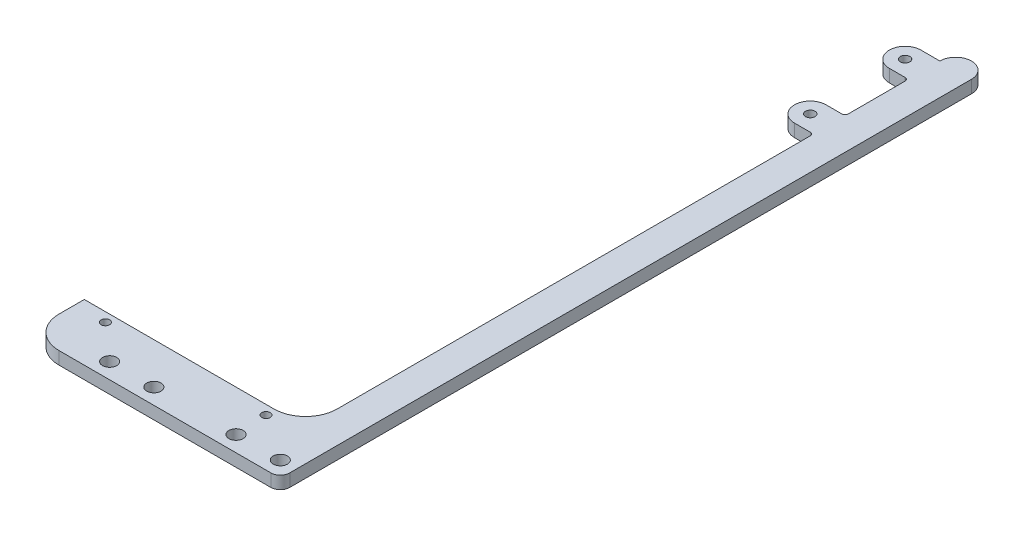
ISO-10303-21;
HEADER;
FILE_DESCRIPTION(('STEP AP214'),'2;1');
FILE_NAME('part.step','',(''),(''),'','','');
FILE_SCHEMA(('AUTOMOTIVE_DESIGN { 1 0 10303 214 1 1 1 1 }'));
ENDSEC;
DATA;
#1=APPLICATION_CONTEXT('core data for automotive mechanical design processes');
#2=APPLICATION_PROTOCOL_DEFINITION('international standard','automotive_design',2000,#1);
#3=PRODUCT_CONTEXT('',#1,'mechanical');
#4=PRODUCT('Part','Part','',(#3));
#5=PRODUCT_RELATED_PRODUCT_CATEGORY('part','',(#4));
#6=PRODUCT_DEFINITION_FORMATION('','',#4);
#7=PRODUCT_DEFINITION_CONTEXT('part definition',#1,'design');
#8=PRODUCT_DEFINITION('design','',#6,#7);
#9=PRODUCT_DEFINITION_SHAPE('','',#8);
#10=(LENGTH_UNIT() NAMED_UNIT(*) SI_UNIT(.MILLI.,.METRE.));
#11=(NAMED_UNIT(*) PLANE_ANGLE_UNIT() SI_UNIT($,.RADIAN.));
#12=(NAMED_UNIT(*) SI_UNIT($,.STERADIAN.) SOLID_ANGLE_UNIT());
#13=UNCERTAINTY_MEASURE_WITH_UNIT(LENGTH_MEASURE(1.E-05),#10,'distance_accuracy_value','');
#14=(GEOMETRIC_REPRESENTATION_CONTEXT(3) GLOBAL_UNCERTAINTY_ASSIGNED_CONTEXT((#13)) GLOBAL_UNIT_ASSIGNED_CONTEXT((#10,
#11,#12)) REPRESENTATION_CONTEXT('',''));
#15=CARTESIAN_POINT('',(0.,0.,0.));
#16=DIRECTION('',(0.,0.,1.));
#17=DIRECTION('',(1.,0.,0.));
#18=AXIS2_PLACEMENT_3D('',#15,#16,#17);
#19=CARTESIAN_POINT('',(0.,4.,0.));
#20=DIRECTION('',(1.,0.,0.));
#21=DIRECTION('',(0.,0.,-1.));
#22=AXIS2_PLACEMENT_3D('',#19,#20,#21);
#23=PLANE('',#22);
#24=DIRECTION('',(0.,0.,1.));
#25=VECTOR('',#24,1.);
#26=CARTESIAN_POINT('',(0.,0.,0.));
#27=LINE('',#26,#25);
#28=CARTESIAN_POINT('',(0.,0.,-143.95));
#29=VERTEX_POINT('',#28);
#30=CARTESIAN_POINT('',(0.,0.,-125.95));
#31=VERTEX_POINT('',#30);
#32=EDGE_CURVE('E312',#29,#31,#27,.T.);
#33=ORIENTED_EDGE('',*,*,#32,.T.);
#34=DIRECTION('',(0.,1.,0.));
#35=VECTOR('',#34,1.);
#36=CARTESIAN_POINT('',(0.,4.,-125.95));
#37=LINE('',#36,#35);
#38=CARTESIAN_POINT('',(0.,4.,-125.95));
#39=VERTEX_POINT('',#38);
#40=EDGE_CURVE('E337',#31,#39,#37,.T.);
#41=ORIENTED_EDGE('',*,*,#40,.T.);
#42=DIRECTION('',(0.,0.,1.));
#43=VECTOR('',#42,1.);
#44=CARTESIAN_POINT('',(0.,4.,0.));
#45=LINE('',#44,#43);
#46=CARTESIAN_POINT('',(0.,4.,-143.95));
#47=VERTEX_POINT('',#46);
#48=EDGE_CURVE('E303',#47,#39,#45,.T.);
#49=ORIENTED_EDGE('',*,*,#48,.F.);
#50=DIRECTION('',(0.,1.,0.));
#51=VECTOR('',#50,1.);
#52=CARTESIAN_POINT('',(0.,0.,-143.95));
#53=LINE('',#52,#51);
#54=EDGE_CURVE('E335',#47,#29,#53,.F.);
#55=ORIENTED_EDGE('',*,*,#54,.T.);
#56=EDGE_LOOP('',(#33,#41,#49,#55));
#57=FACE_BOUND('',#56,.T.);
#58=ADVANCED_FACE('F35',(#57),#23,.F.);
#59=CARTESIAN_POINT('',(0.,0.,-113.95));
#60=VERTEX_POINT('',#59);
#61=CARTESIAN_POINT('',(0.,0.,35.7));
#62=VERTEX_POINT('',#61);
#63=EDGE_CURVE('E311',#60,#62,#27,.T.);
#64=ORIENTED_EDGE('',*,*,#63,.T.);
#65=DIRECTION('',(0.,1.,0.));
#66=VECTOR('',#65,1.);
#67=CARTESIAN_POINT('',(0.,4.,35.7));
#68=LINE('',#67,#66);
#69=CARTESIAN_POINT('',(0.,4.,35.7));
#70=VERTEX_POINT('',#69);
#71=EDGE_CURVE('E356',#62,#70,#68,.T.);
#72=ORIENTED_EDGE('',*,*,#71,.T.);
#73=CARTESIAN_POINT('',(0.,4.,-113.95));
#74=VERTEX_POINT('',#73);
#75=EDGE_CURVE('E301',#74,#70,#45,.T.);
#76=ORIENTED_EDGE('',*,*,#75,.F.);
#77=DIRECTION('',(0.,1.,0.));
#78=VECTOR('',#77,1.);
#79=CARTESIAN_POINT('',(0.,0.,-113.95));
#80=LINE('',#79,#78);
#81=EDGE_CURVE('E333',#74,#60,#80,.F.);
#82=ORIENTED_EDGE('',*,*,#81,.T.);
#83=EDGE_LOOP('',(#64,#72,#76,#82));
#84=FACE_BOUND('',#83,.T.);
#85=ADVANCED_FACE('F363',(#84),#23,.F.);
#86=CARTESIAN_POINT('',(5.,4.,-154.95));
#87=DIRECTION('',(0.,-1.,0.));
#88=DIRECTION('',(0.,0.,-1.));
#89=AXIS2_PLACEMENT_3D('',#86,#87,#88);
#90=CYLINDRICAL_SURFACE('',#89,5.);
#91=CARTESIAN_POINT('',(5.,0.,-154.95));
#92=DIRECTION('',(0.,1.,0.));
#93=DIRECTION('',(0.,0.,1.));
#94=AXIS2_PLACEMENT_3D('',#91,#92,#93);
#95=CIRCLE('',#94,5.);
#96=CARTESIAN_POINT('',(0.,0.,-154.95));
#97=VERTEX_POINT('',#96);
#98=CARTESIAN_POINT('',(10.,0.,-154.95));
#99=VERTEX_POINT('',#98);
#100=EDGE_CURVE('E294',#97,#99,#95,.F.);
#101=ORIENTED_EDGE('',*,*,#100,.F.);
#102=DIRECTION('',(0.,-1.,0.));
#103=VECTOR('',#102,1.);
#104=CARTESIAN_POINT('',(0.,4.,-154.95));
#105=LINE('',#104,#103);
#106=CARTESIAN_POINT('',(0.,4.,-154.95));
#107=VERTEX_POINT('',#106);
#108=EDGE_CURVE('E318',#107,#97,#105,.T.);
#109=ORIENTED_EDGE('',*,*,#108,.F.);
#110=CARTESIAN_POINT('',(5.,4.,-154.95));
#111=DIRECTION('',(0.,1.,0.));
#112=DIRECTION('',(0.,0.,1.));
#113=AXIS2_PLACEMENT_3D('',#110,#111,#112);
#114=CIRCLE('',#113,5.);
#115=CARTESIAN_POINT('',(10.,4.,-154.95));
#116=VERTEX_POINT('',#115);
#117=EDGE_CURVE('E298',#107,#116,#114,.F.);
#118=ORIENTED_EDGE('',*,*,#117,.T.);
#119=DIRECTION('',(0.,-1.,0.));
#120=VECTOR('',#119,1.);
#121=CARTESIAN_POINT('',(10.,4.,-154.95));
#122=LINE('',#121,#120);
#123=EDGE_CURVE('E308',#116,#99,#122,.T.);
#124=ORIENTED_EDGE('',*,*,#123,.T.);
#125=EDGE_LOOP('',(#101,#109,#118,#124));
#126=FACE_BOUND('',#125,.T.);
#127=ADVANCED_FACE('F403',(#126),#90,.T.);
#128=CARTESIAN_POINT('',(9.99999999999998,4.,0.));
#129=DIRECTION('',(-1.,0.,0.));
#130=DIRECTION('',(0.,0.,1.));
#131=AXIS2_PLACEMENT_3D('',#128,#129,#130);
#132=PLANE('',#131);
#133=DIRECTION('',(0.,0.,-1.));
#134=VECTOR('',#133,1.);
#135=CARTESIAN_POINT('',(9.99999999999998,4.,0.));
#136=LINE('',#135,#134);
#137=CARTESIAN_POINT('',(9.99999999999997,4.,60.7));
#138=VERTEX_POINT('',#137);
#139=EDGE_CURVE('E306',#138,#116,#136,.T.);
#140=ORIENTED_EDGE('',*,*,#139,.F.);
#141=DIRECTION('',(0.,1.,0.));
#142=VECTOR('',#141,1.);
#143=CARTESIAN_POINT('',(9.99999999999997,0.,60.7));
#144=LINE('',#143,#142);
#145=CARTESIAN_POINT('',(9.99999999999997,0.,60.7));
#146=VERTEX_POINT('',#145);
#147=EDGE_CURVE('E326',#138,#146,#144,.F.);
#148=ORIENTED_EDGE('',*,*,#147,.T.);
#149=DIRECTION('',(0.,0.,-1.));
#150=VECTOR('',#149,1.);
#151=CARTESIAN_POINT('',(9.99999999999998,0.,0.));
#152=LINE('',#151,#150);
#153=EDGE_CURVE('E302',#146,#99,#152,.T.);
#154=ORIENTED_EDGE('',*,*,#153,.T.);
#155=ORIENTED_EDGE('',*,*,#123,.F.);
#156=EDGE_LOOP('',(#140,#148,#154,#155));
#157=FACE_BOUND('',#156,.T.);
#158=ADVANCED_FACE('F408',(#157),#132,.F.);
#159=CARTESIAN_POINT('',(0.,4.,0.));
#160=DIRECTION('',(0.,1.,0.));
#161=DIRECTION('',(0.,0.,1.));
#162=AXIS2_PLACEMENT_3D('',#159,#160,#161);
#163=PLANE('',#162);
#164=DIRECTION('',(1.,0.,0.));
#165=VECTOR('',#164,1.);
#166=CARTESIAN_POINT('',(0.,4.,63.7));
#167=LINE('',#166,#165);
#168=CARTESIAN_POINT('',(-60.,4.,63.7));
#169=VERTEX_POINT('',#168);
#170=CARTESIAN_POINT('',(6.99999999999997,4.,63.7));
#171=VERTEX_POINT('',#170);
#172=EDGE_CURVE('E287',#169,#171,#167,.T.);
#173=ORIENTED_EDGE('',*,*,#172,.T.);
#174=CARTESIAN_POINT('',(6.99999999999997,4.,60.7));
#175=DIRECTION('',(0.,1.,0.));
#176=DIRECTION('',(0.,0.,1.));
#177=AXIS2_PLACEMENT_3D('',#174,#175,#176);
#178=CIRCLE('',#177,3.);
#179=EDGE_CURVE('E324',#171,#138,#178,.T.);
#180=ORIENTED_EDGE('',*,*,#179,.T.);
#181=ORIENTED_EDGE('',*,*,#139,.T.);
#182=ORIENTED_EDGE('',*,*,#117,.F.);
#183=DIRECTION('',(1.,0.,0.));
#184=VECTOR('',#183,1.);
#185=CARTESIAN_POINT('',(7.16787740273617E-13,4.,-154.95));
#186=LINE('',#185,#184);
#187=CARTESIAN_POINT('',(-6.,4.,-154.95));
#188=VERTEX_POINT('',#187);
#189=EDGE_CURVE('E221',#188,#107,#186,.T.);
#190=ORIENTED_EDGE('',*,*,#189,.F.);
#191=CARTESIAN_POINT('',(-6.,4.,-149.95));
#192=DIRECTION('',(0.,1.,0.));
#193=DIRECTION('',(0.,0.,1.));
#194=AXIS2_PLACEMENT_3D('',#191,#192,#193);
#195=CIRCLE('',#194,5.00000000000003);
#196=CARTESIAN_POINT('',(-6.,4.,-144.95));
#197=VERTEX_POINT('',#196);
#198=EDGE_CURVE('E224',#188,#197,#195,.T.);
#199=ORIENTED_EDGE('',*,*,#198,.T.);
#200=DIRECTION('',(-1.,0.,0.));
#201=VECTOR('',#200,1.);
#202=CARTESIAN_POINT('',(0.,4.,-144.95));
#203=LINE('',#202,#201);
#204=CARTESIAN_POINT('',(-1.,4.,-144.95));
#205=VERTEX_POINT('',#204);
#206=EDGE_CURVE('E210',#205,#197,#203,.T.);
#207=ORIENTED_EDGE('',*,*,#206,.F.);
#208=CARTESIAN_POINT('',(-1.,4.,-143.95));
#209=DIRECTION('',(0.,1.,0.));
#210=DIRECTION('',(0.,0.,1.));
#211=AXIS2_PLACEMENT_3D('',#208,#209,#210);
#212=CIRCLE('',#211,1.);
#213=EDGE_CURVE('E352',#205,#47,#212,.F.);
#214=ORIENTED_EDGE('',*,*,#213,.T.);
#215=ORIENTED_EDGE('',*,*,#48,.T.);
#216=CARTESIAN_POINT('',(-1.,4.,-125.95));
#217=DIRECTION('',(0.,1.,0.));
#218=DIRECTION('',(0.,0.,1.));
#219=AXIS2_PLACEMENT_3D('',#216,#217,#218);
#220=CIRCLE('',#219,1.);
#221=CARTESIAN_POINT('',(-1.,4.,-124.95));
#222=VERTEX_POINT('',#221);
#223=EDGE_CURVE('E348',#39,#222,#220,.F.);
#224=ORIENTED_EDGE('',*,*,#223,.T.);
#225=DIRECTION('',(1.,0.,0.));
#226=VECTOR('',#225,1.);
#227=CARTESIAN_POINT('',(0.,4.,-124.95));
#228=LINE('',#227,#226);
#229=CARTESIAN_POINT('',(-6.,4.,-124.95));
#230=VERTEX_POINT('',#229);
#231=EDGE_CURVE('E199',#230,#222,#228,.T.);
#232=ORIENTED_EDGE('',*,*,#231,.F.);
#233=CARTESIAN_POINT('',(-6.,4.,-119.95));
#234=DIRECTION('',(0.,1.,0.));
#235=DIRECTION('',(0.,0.,1.));
#236=AXIS2_PLACEMENT_3D('',#233,#234,#235);
#237=CIRCLE('',#236,5.);
#238=CARTESIAN_POINT('',(-6.,4.,-114.95));
#239=VERTEX_POINT('',#238);
#240=EDGE_CURVE('E171',#230,#239,#237,.T.);
#241=ORIENTED_EDGE('',*,*,#240,.T.);
#242=DIRECTION('',(-1.,0.,0.));
#243=VECTOR('',#242,1.);
#244=CARTESIAN_POINT('',(0.,4.,-114.95));
#245=LINE('',#244,#243);
#246=CARTESIAN_POINT('',(-1.,4.,-114.95));
#247=VERTEX_POINT('',#246);
#248=EDGE_CURVE('E202',#247,#239,#245,.T.);
#249=ORIENTED_EDGE('',*,*,#248,.F.);
#250=CARTESIAN_POINT('',(-1.,4.,-113.95));
#251=DIRECTION('',(0.,1.,0.));
#252=DIRECTION('',(0.,0.,1.));
#253=AXIS2_PLACEMENT_3D('',#250,#251,#252);
#254=CIRCLE('',#253,1.);
#255=EDGE_CURVE('E344',#247,#74,#254,.F.);
#256=ORIENTED_EDGE('',*,*,#255,.T.);
#257=ORIENTED_EDGE('',*,*,#75,.T.);
#258=CARTESIAN_POINT('',(-10.,4.,35.7));
#259=DIRECTION('',(0.,1.,0.));
#260=DIRECTION('',(0.,0.,1.));
#261=AXIS2_PLACEMENT_3D('',#258,#259,#260);
#262=CIRCLE('',#261,10.);
#263=CARTESIAN_POINT('',(-10.,4.,45.7));
#264=VERTEX_POINT('',#263);
#265=EDGE_CURVE('E43',#70,#264,#262,.F.);
#266=ORIENTED_EDGE('',*,*,#265,.T.);
#267=DIRECTION('',(-1.,0.,0.));
#268=VECTOR('',#267,1.);
#269=CARTESIAN_POINT('',(0.,4.,45.7));
#270=LINE('',#269,#268);
#271=CARTESIAN_POINT('',(-70.,4.,45.7));
#272=VERTEX_POINT('',#271);
#273=EDGE_CURVE('E237',#264,#272,#270,.T.);
#274=ORIENTED_EDGE('',*,*,#273,.T.);
#275=DIRECTION('',(0.,0.,1.));
#276=VECTOR('',#275,1.);
#277=CARTESIAN_POINT('',(-70.,4.,0.));
#278=LINE('',#277,#276);
#279=CARTESIAN_POINT('',(-70.,4.,53.7));
#280=VERTEX_POINT('',#279);
#281=EDGE_CURVE('E281',#272,#280,#278,.T.);
#282=ORIENTED_EDGE('',*,*,#281,.T.);
#283=CARTESIAN_POINT('',(-60.,4.,53.7));
#284=DIRECTION('',(0.,1.,0.));
#285=DIRECTION('',(0.,0.,1.));
#286=AXIS2_PLACEMENT_3D('',#283,#284,#285);
#287=CIRCLE('',#286,10.);
#288=EDGE_CURVE('E284',#280,#169,#287,.T.);
#289=ORIENTED_EDGE('',*,*,#288,.T.);
#290=EDGE_LOOP('',(#173,#180,#181,#182,#190,#199,#207,#214,#215,#224,#232,#241,#249,#256,#257,
#266,#274,#282,#289));
#291=FACE_BOUND('',#290,.T.);
#292=CARTESIAN_POINT('',(-60.4,4.,48.62));
#293=DIRECTION('',(0.,1.,0.));
#294=DIRECTION('',(0.,0.,1.));
#295=AXIS2_PLACEMENT_3D('',#292,#293,#294);
#296=CIRCLE('',#295,1.35);
#297=CARTESIAN_POINT('',(-60.4,4.,49.97));
#298=VERTEX_POINT('',#297);
#299=EDGE_CURVE('E231',#298,#298,#296,.T.);
#300=ORIENTED_EDGE('',*,*,#299,.F.);
#301=EDGE_LOOP('',(#300));
#302=FACE_BOUND('',#301,.T.);
#303=CARTESIAN_POINT('',(-49.,4.,58.7));
#304=DIRECTION('',(0.,1.,0.));
#305=DIRECTION('',(0.,0.,1.));
#306=AXIS2_PLACEMENT_3D('',#303,#304,#305);
#307=CIRCLE('',#306,2.25);
#308=CARTESIAN_POINT('',(-49.,4.,60.95));
#309=VERTEX_POINT('',#308);
#310=EDGE_CURVE('E266',#309,#309,#307,.T.);
#311=ORIENTED_EDGE('',*,*,#310,.F.);
#312=EDGE_LOOP('',(#311));
#313=FACE_BOUND('',#312,.T.);
#314=CARTESIAN_POINT('',(-35.,4.,58.7));
#315=DIRECTION('',(0.,1.,0.));
#316=DIRECTION('',(0.,0.,1.));
#317=AXIS2_PLACEMENT_3D('',#314,#315,#316);
#318=CIRCLE('',#317,2.25);
#319=CARTESIAN_POINT('',(-35.,4.,60.95));
#320=VERTEX_POINT('',#319);
#321=EDGE_CURVE('E269',#320,#320,#318,.T.);
#322=ORIENTED_EDGE('',*,*,#321,.F.);
#323=EDGE_LOOP('',(#322));
#324=FACE_BOUND('',#323,.T.);
#325=CARTESIAN_POINT('',(-9.00000000000001,4.,58.7));
#326=DIRECTION('',(0.,1.,0.));
#327=DIRECTION('',(0.,0.,1.));
#328=AXIS2_PLACEMENT_3D('',#325,#326,#327);
#329=CIRCLE('',#328,2.25000000000001);
#330=CARTESIAN_POINT('',(-9.00000000000001,4.,60.95));
#331=VERTEX_POINT('',#330);
#332=EDGE_CURVE('E272',#331,#331,#329,.T.);
#333=ORIENTED_EDGE('',*,*,#332,.F.);
#334=EDGE_LOOP('',(#333));
#335=FACE_BOUND('',#334,.T.);
#336=CARTESIAN_POINT('',(4.99999999999999,4.,58.7));
#337=DIRECTION('',(0.,1.,0.));
#338=DIRECTION('',(0.,0.,1.));
#339=AXIS2_PLACEMENT_3D('',#336,#337,#338);
#340=CIRCLE('',#339,2.25000000000001);
#341=CARTESIAN_POINT('',(4.99999999999999,4.,60.95));
#342=VERTEX_POINT('',#341);
#343=EDGE_CURVE('E275',#342,#342,#340,.T.);
#344=ORIENTED_EDGE('',*,*,#343,.F.);
#345=EDGE_LOOP('',(#344));
#346=FACE_BOUND('',#345,.T.);
#347=CARTESIAN_POINT('',(-9.6,4.,48.62));
#348=DIRECTION('',(0.,1.,0.));
#349=DIRECTION('',(0.,0.,1.));
#350=AXIS2_PLACEMENT_3D('',#347,#348,#349);
#351=CIRCLE('',#350,1.35);
#352=CARTESIAN_POINT('',(-9.6,4.,49.97));
#353=VERTEX_POINT('',#352);
#354=EDGE_CURVE('E278',#353,#353,#351,.T.);
#355=ORIENTED_EDGE('',*,*,#354,.F.);
#356=EDGE_LOOP('',(#355));
#357=FACE_BOUND('',#356,.T.);
#358=CARTESIAN_POINT('',(-6.,4.,-149.95));
#359=DIRECTION('',(0.,1.,0.));
#360=DIRECTION('',(0.,0.,1.));
#361=AXIS2_PLACEMENT_3D('',#358,#359,#360);
#362=CIRCLE('',#361,1.5);
#363=CARTESIAN_POINT('',(-6.,4.,-148.45));
#364=VERTEX_POINT('',#363);
#365=EDGE_CURVE('E204',#364,#364,#362,.T.);
#366=ORIENTED_EDGE('',*,*,#365,.F.);
#367=EDGE_LOOP('',(#366));
#368=FACE_BOUND('',#367,.T.);
#369=CARTESIAN_POINT('',(-6.,4.,-119.95));
#370=DIRECTION('',(0.,1.,0.));
#371=DIRECTION('',(0.,0.,1.));
#372=AXIS2_PLACEMENT_3D('',#369,#370,#371);
#373=CIRCLE('',#372,1.5);
#374=CARTESIAN_POINT('',(-6.,4.,-118.45));
#375=VERTEX_POINT('',#374);
#376=EDGE_CURVE('E196',#375,#375,#373,.T.);
#377=ORIENTED_EDGE('',*,*,#376,.F.);
#378=EDGE_LOOP('',(#377));
#379=FACE_BOUND('',#378,.T.);
#380=ADVANCED_FACE('F368',(#291,#302,#313,#324,#335,#346,#357,#368,#379),#163,.T.);
#381=CARTESIAN_POINT('',(0.,0.,0.));
#382=DIRECTION('',(0.,1.,0.));
#383=DIRECTION('',(0.,0.,1.));
#384=AXIS2_PLACEMENT_3D('',#381,#382,#383);
#385=PLANE('',#384);
#386=ORIENTED_EDGE('',*,*,#153,.F.);
#387=CARTESIAN_POINT('',(6.99999999999997,0.,60.7));
#388=DIRECTION('',(0.,1.,0.));
#389=DIRECTION('',(0.,0.,1.));
#390=AXIS2_PLACEMENT_3D('',#387,#388,#389);
#391=CIRCLE('',#390,3.);
#392=CARTESIAN_POINT('',(6.99999999999997,0.,63.7));
#393=VERTEX_POINT('',#392);
#394=EDGE_CURVE('E328',#146,#393,#391,.F.);
#395=ORIENTED_EDGE('',*,*,#394,.T.);
#396=DIRECTION('',(1.,0.,0.));
#397=VECTOR('',#396,1.);
#398=CARTESIAN_POINT('',(0.,0.,63.7));
#399=LINE('',#398,#397);
#400=CARTESIAN_POINT('',(-60.,0.,63.7));
#401=VERTEX_POINT('',#400);
#402=EDGE_CURVE('E258',#401,#393,#399,.T.);
#403=ORIENTED_EDGE('',*,*,#402,.F.);
#404=CARTESIAN_POINT('',(-60.,0.,53.7));
#405=DIRECTION('',(0.,1.,0.));
#406=DIRECTION('',(0.,0.,1.));
#407=AXIS2_PLACEMENT_3D('',#404,#405,#406);
#408=CIRCLE('',#407,10.);
#409=CARTESIAN_POINT('',(-70.,0.,53.7));
#410=VERTEX_POINT('',#409);
#411=EDGE_CURVE('E255',#410,#401,#408,.T.);
#412=ORIENTED_EDGE('',*,*,#411,.F.);
#413=DIRECTION('',(0.,0.,1.));
#414=VECTOR('',#413,1.);
#415=CARTESIAN_POINT('',(-70.,0.,0.));
#416=LINE('',#415,#414);
#417=CARTESIAN_POINT('',(-70.,0.,45.7));
#418=VERTEX_POINT('',#417);
#419=EDGE_CURVE('E252',#418,#410,#416,.T.);
#420=ORIENTED_EDGE('',*,*,#419,.F.);
#421=DIRECTION('',(-1.,0.,0.));
#422=VECTOR('',#421,1.);
#423=CARTESIAN_POINT('',(0.,0.,45.7));
#424=LINE('',#423,#422);
#425=CARTESIAN_POINT('',(-10.,0.,45.7));
#426=VERTEX_POINT('',#425);
#427=EDGE_CURVE('E261',#426,#418,#424,.T.);
#428=ORIENTED_EDGE('',*,*,#427,.F.);
#429=CARTESIAN_POINT('',(-10.,0.,35.7));
#430=DIRECTION('',(0.,1.,0.));
#431=DIRECTION('',(0.,0.,1.));
#432=AXIS2_PLACEMENT_3D('',#429,#430,#431);
#433=CIRCLE('',#432,10.);
#434=EDGE_CURVE('E11',#426,#62,#433,.T.);
#435=ORIENTED_EDGE('',*,*,#434,.T.);
#436=ORIENTED_EDGE('',*,*,#63,.F.);
#437=CARTESIAN_POINT('',(-1.,0.,-113.95));
#438=DIRECTION('',(0.,1.,0.));
#439=DIRECTION('',(0.,0.,1.));
#440=AXIS2_PLACEMENT_3D('',#437,#438,#439);
#441=CIRCLE('',#440,1.);
#442=CARTESIAN_POINT('',(-1.,0.,-114.95));
#443=VERTEX_POINT('',#442);
#444=EDGE_CURVE('E346',#60,#443,#441,.T.);
#445=ORIENTED_EDGE('',*,*,#444,.T.);
#446=DIRECTION('',(-1.,0.,0.));
#447=VECTOR('',#446,1.);
#448=CARTESIAN_POINT('',(0.,0.,-114.95));
#449=LINE('',#448,#447);
#450=CARTESIAN_POINT('',(-6.,0.,-114.95));
#451=VERTEX_POINT('',#450);
#452=EDGE_CURVE('E176',#443,#451,#449,.T.);
#453=ORIENTED_EDGE('',*,*,#452,.T.);
#454=CARTESIAN_POINT('',(-6.,0.,-119.95));
#455=DIRECTION('',(0.,1.,0.));
#456=DIRECTION('',(0.,0.,1.));
#457=AXIS2_PLACEMENT_3D('',#454,#455,#456);
#458=CIRCLE('',#457,5.);
#459=CARTESIAN_POINT('',(-6.,0.,-124.95));
#460=VERTEX_POINT('',#459);
#461=EDGE_CURVE('E169',#460,#451,#458,.T.);
#462=ORIENTED_EDGE('',*,*,#461,.F.);
#463=DIRECTION('',(1.,0.,0.));
#464=VECTOR('',#463,1.);
#465=CARTESIAN_POINT('',(0.,0.,-124.95));
#466=LINE('',#465,#464);
#467=CARTESIAN_POINT('',(-1.,0.,-124.95));
#468=VERTEX_POINT('',#467);
#469=EDGE_CURVE('E179',#460,#468,#466,.T.);
#470=ORIENTED_EDGE('',*,*,#469,.T.);
#471=CARTESIAN_POINT('',(-1.,0.,-125.95));
#472=DIRECTION('',(0.,1.,0.));
#473=DIRECTION('',(0.,0.,1.));
#474=AXIS2_PLACEMENT_3D('',#471,#472,#473);
#475=CIRCLE('',#474,1.);
#476=EDGE_CURVE('E350',#468,#31,#475,.T.);
#477=ORIENTED_EDGE('',*,*,#476,.T.);
#478=ORIENTED_EDGE('',*,*,#32,.F.);
#479=CARTESIAN_POINT('',(-1.,0.,-143.95));
#480=DIRECTION('',(0.,1.,0.));
#481=DIRECTION('',(0.,0.,1.));
#482=AXIS2_PLACEMENT_3D('',#479,#480,#481);
#483=CIRCLE('',#482,1.);
#484=CARTESIAN_POINT('',(-1.,0.,-144.95));
#485=VERTEX_POINT('',#484);
#486=EDGE_CURVE('E354',#29,#485,#483,.T.);
#487=ORIENTED_EDGE('',*,*,#486,.T.);
#488=DIRECTION('',(-1.,0.,0.));
#489=VECTOR('',#488,1.);
#490=CARTESIAN_POINT('',(0.,0.,-144.95));
#491=LINE('',#490,#489);
#492=CARTESIAN_POINT('',(-6.,0.,-144.95));
#493=VERTEX_POINT('',#492);
#494=EDGE_CURVE('E216',#485,#493,#491,.T.);
#495=ORIENTED_EDGE('',*,*,#494,.T.);
#496=CARTESIAN_POINT('',(-6.,0.,-149.95));
#497=DIRECTION('',(0.,1.,0.));
#498=DIRECTION('',(0.,0.,1.));
#499=AXIS2_PLACEMENT_3D('',#496,#497,#498);
#500=CIRCLE('',#499,5.00000000000003);
#501=CARTESIAN_POINT('',(-6.,0.,-154.95));
#502=VERTEX_POINT('',#501);
#503=EDGE_CURVE('E213',#502,#493,#500,.T.);
#504=ORIENTED_EDGE('',*,*,#503,.F.);
#505=DIRECTION('',(1.,0.,0.));
#506=VECTOR('',#505,1.);
#507=CARTESIAN_POINT('',(7.16787740273617E-13,0.,-154.95));
#508=LINE('',#507,#506);
#509=EDGE_CURVE('E209',#502,#97,#508,.T.);
#510=ORIENTED_EDGE('',*,*,#509,.T.);
#511=ORIENTED_EDGE('',*,*,#100,.T.);
#512=EDGE_LOOP('',(#386,#395,#403,#412,#420,#428,#435,#436,#445,#453,#462,#470,#477,#478,#487,
#495,#504,#510,#511));
#513=FACE_BOUND('',#512,.T.);
#514=CARTESIAN_POINT('',(-60.4,0.,48.62));
#515=DIRECTION('',(0.,1.,0.));
#516=DIRECTION('',(0.,0.,1.));
#517=AXIS2_PLACEMENT_3D('',#514,#515,#516);
#518=CIRCLE('',#517,1.35);
#519=CARTESIAN_POINT('',(-60.4,0.,49.97));
#520=VERTEX_POINT('',#519);
#521=EDGE_CURVE('E233',#520,#520,#518,.T.);
#522=ORIENTED_EDGE('',*,*,#521,.T.);
#523=EDGE_LOOP('',(#522));
#524=FACE_BOUND('',#523,.T.);
#525=CARTESIAN_POINT('',(-49.,0.,58.7));
#526=DIRECTION('',(0.,1.,0.));
#527=DIRECTION('',(0.,0.,1.));
#528=AXIS2_PLACEMENT_3D('',#525,#526,#527);
#529=CIRCLE('',#528,2.25);
#530=CARTESIAN_POINT('',(-49.,0.,60.95));
#531=VERTEX_POINT('',#530);
#532=EDGE_CURVE('E236',#531,#531,#529,.T.);
#533=ORIENTED_EDGE('',*,*,#532,.T.);
#534=EDGE_LOOP('',(#533));
#535=FACE_BOUND('',#534,.T.);
#536=CARTESIAN_POINT('',(-35.,0.,58.7));
#537=DIRECTION('',(0.,1.,0.));
#538=DIRECTION('',(0.,0.,1.));
#539=AXIS2_PLACEMENT_3D('',#536,#537,#538);
#540=CIRCLE('',#539,2.25);
#541=CARTESIAN_POINT('',(-35.,0.,60.95));
#542=VERTEX_POINT('',#541);
#543=EDGE_CURVE('E240',#542,#542,#540,.T.);
#544=ORIENTED_EDGE('',*,*,#543,.T.);
#545=EDGE_LOOP('',(#544));
#546=FACE_BOUND('',#545,.T.);
#547=CARTESIAN_POINT('',(-9.00000000000001,0.,58.7));
#548=DIRECTION('',(0.,1.,0.));
#549=DIRECTION('',(0.,0.,1.));
#550=AXIS2_PLACEMENT_3D('',#547,#548,#549);
#551=CIRCLE('',#550,2.25000000000001);
#552=CARTESIAN_POINT('',(-9.00000000000001,0.,60.95));
#553=VERTEX_POINT('',#552);
#554=EDGE_CURVE('E243',#553,#553,#551,.T.);
#555=ORIENTED_EDGE('',*,*,#554,.T.);
#556=EDGE_LOOP('',(#555));
#557=FACE_BOUND('',#556,.T.);
#558=CARTESIAN_POINT('',(4.99999999999999,0.,58.7));
#559=DIRECTION('',(0.,1.,0.));
#560=DIRECTION('',(0.,0.,1.));
#561=AXIS2_PLACEMENT_3D('',#558,#559,#560);
#562=CIRCLE('',#561,2.25000000000001);
#563=CARTESIAN_POINT('',(4.99999999999999,0.,60.95));
#564=VERTEX_POINT('',#563);
#565=EDGE_CURVE('E246',#564,#564,#562,.T.);
#566=ORIENTED_EDGE('',*,*,#565,.T.);
#567=EDGE_LOOP('',(#566));
#568=FACE_BOUND('',#567,.T.);
#569=CARTESIAN_POINT('',(-9.6,0.,48.62));
#570=DIRECTION('',(0.,1.,0.));
#571=DIRECTION('',(0.,0.,1.));
#572=AXIS2_PLACEMENT_3D('',#569,#570,#571);
#573=CIRCLE('',#572,1.35);
#574=CARTESIAN_POINT('',(-9.6,0.,49.97));
#575=VERTEX_POINT('',#574);
#576=EDGE_CURVE('E249',#575,#575,#573,.T.);
#577=ORIENTED_EDGE('',*,*,#576,.T.);
#578=EDGE_LOOP('',(#577));
#579=FACE_BOUND('',#578,.T.);
#580=CARTESIAN_POINT('',(-6.,0.,-149.95));
#581=DIRECTION('',(0.,1.,0.));
#582=DIRECTION('',(0.,0.,1.));
#583=AXIS2_PLACEMENT_3D('',#580,#581,#582);
#584=CIRCLE('',#583,1.5);
#585=CARTESIAN_POINT('',(-6.,0.,-148.45));
#586=VERTEX_POINT('',#585);
#587=EDGE_CURVE('E206',#586,#586,#584,.T.);
#588=ORIENTED_EDGE('',*,*,#587,.T.);
#589=EDGE_LOOP('',(#588));
#590=FACE_BOUND('',#589,.T.);
#591=CARTESIAN_POINT('',(-6.,0.,-119.95));
#592=DIRECTION('',(0.,1.,0.));
#593=DIRECTION('',(0.,0.,1.));
#594=AXIS2_PLACEMENT_3D('',#591,#592,#593);
#595=CIRCLE('',#594,1.5);
#596=CARTESIAN_POINT('',(-6.,0.,-118.45));
#597=VERTEX_POINT('',#596);
#598=EDGE_CURVE('E185',#597,#597,#595,.T.);
#599=ORIENTED_EDGE('',*,*,#598,.T.);
#600=EDGE_LOOP('',(#599));
#601=FACE_BOUND('',#600,.T.);
#602=ADVANCED_FACE('F188',(#513,#524,#535,#546,#557,#568,#579,#590,#601),#385,.F.);
#603=CARTESIAN_POINT('',(-70.,0.,0.));
#604=DIRECTION('',(-1.,0.,0.));
#605=DIRECTION('',(0.,0.,1.));
#606=AXIS2_PLACEMENT_3D('',#603,#604,#605);
#607=PLANE('',#606);
#608=ORIENTED_EDGE('',*,*,#281,.F.);
#609=DIRECTION('',(0.,1.,0.));
#610=VECTOR('',#609,1.);
#611=CARTESIAN_POINT('',(-70.,0.,45.7));
#612=LINE('',#611,#610);
#613=EDGE_CURVE('E291',#418,#272,#612,.T.);
#614=ORIENTED_EDGE('',*,*,#613,.F.);
#615=ORIENTED_EDGE('',*,*,#419,.T.);
#616=DIRECTION('',(0.,1.,0.));
#617=VECTOR('',#616,1.);
#618=CARTESIAN_POINT('',(-70.,0.,53.7));
#619=LINE('',#618,#617);
#620=EDGE_CURVE('E263',#410,#280,#619,.T.);
#621=ORIENTED_EDGE('',*,*,#620,.T.);
#622=EDGE_LOOP('',(#608,#614,#615,#621));
#623=FACE_BOUND('',#622,.T.);
#624=ADVANCED_FACE('F425',(#623),#607,.T.);
#625=CARTESIAN_POINT('',(0.,0.,45.7));
#626=DIRECTION('',(0.,0.,-1.));
#627=DIRECTION('',(-1.,0.,0.));
#628=AXIS2_PLACEMENT_3D('',#625,#626,#627);
#629=PLANE('',#628);
#630=ORIENTED_EDGE('',*,*,#273,.F.);
#631=DIRECTION('',(0.,1.,0.));
#632=VECTOR('',#631,1.);
#633=CARTESIAN_POINT('',(-10.,0.,45.7));
#634=LINE('',#633,#632);
#635=EDGE_CURVE('E50',#264,#426,#634,.F.);
#636=ORIENTED_EDGE('',*,*,#635,.T.);
#637=ORIENTED_EDGE('',*,*,#427,.T.);
#638=ORIENTED_EDGE('',*,*,#613,.T.);
#639=EDGE_LOOP('',(#630,#636,#637,#638));
#640=FACE_BOUND('',#639,.T.);
#641=ADVANCED_FACE('F426',(#640),#629,.T.);
#642=CARTESIAN_POINT('',(0.,0.,63.7));
#643=DIRECTION('',(0.,0.,1.));
#644=DIRECTION('',(1.,0.,0.));
#645=AXIS2_PLACEMENT_3D('',#642,#643,#644);
#646=PLANE('',#645);
#647=ORIENTED_EDGE('',*,*,#402,.T.);
#648=DIRECTION('',(0.,1.,0.));
#649=VECTOR('',#648,1.);
#650=CARTESIAN_POINT('',(6.99999999999997,4.,63.7));
#651=LINE('',#650,#649);
#652=EDGE_CURVE('E321',#393,#171,#651,.T.);
#653=ORIENTED_EDGE('',*,*,#652,.T.);
#654=ORIENTED_EDGE('',*,*,#172,.F.);
#655=DIRECTION('',(0.,1.,0.));
#656=VECTOR('',#655,1.);
#657=CARTESIAN_POINT('',(-60.,0.,63.7));
#658=LINE('',#657,#656);
#659=EDGE_CURVE('E295',#401,#169,#658,.T.);
#660=ORIENTED_EDGE('',*,*,#659,.F.);
#661=EDGE_LOOP('',(#647,#653,#654,#660));
#662=FACE_BOUND('',#661,.T.);
#663=ADVANCED_FACE('F416',(#662),#646,.T.);
#664=CARTESIAN_POINT('',(-9.6,0.,48.62));
#665=DIRECTION('',(0.,1.,0.));
#666=DIRECTION('',(0.,0.,1.));
#667=AXIS2_PLACEMENT_3D('',#664,#665,#666);
#668=CYLINDRICAL_SURFACE('',#667,1.35);
#669=ORIENTED_EDGE('',*,*,#576,.F.);
#670=EDGE_LOOP('',(#669));
#671=FACE_BOUND('',#670,.T.);
#672=ORIENTED_EDGE('',*,*,#354,.T.);
#673=EDGE_LOOP('',(#672));
#674=FACE_BOUND('',#673,.T.);
#675=ADVANCED_FACE('F507',(#671,#674),#668,.F.);
#676=CARTESIAN_POINT('',(4.99999999999999,0.,58.7));
#677=DIRECTION('',(0.,1.,0.));
#678=DIRECTION('',(0.,0.,1.));
#679=AXIS2_PLACEMENT_3D('',#676,#677,#678);
#680=CYLINDRICAL_SURFACE('',#679,2.25000000000001);
#681=ORIENTED_EDGE('',*,*,#565,.F.);
#682=EDGE_LOOP('',(#681));
#683=FACE_BOUND('',#682,.T.);
#684=ORIENTED_EDGE('',*,*,#343,.T.);
#685=EDGE_LOOP('',(#684));
#686=FACE_BOUND('',#685,.T.);
#687=ADVANCED_FACE('F515',(#683,#686),#680,.F.);
#688=CARTESIAN_POINT('',(-9.00000000000001,0.,58.7));
#689=DIRECTION('',(0.,1.,0.));
#690=DIRECTION('',(0.,0.,1.));
#691=AXIS2_PLACEMENT_3D('',#688,#689,#690);
#692=CYLINDRICAL_SURFACE('',#691,2.25000000000001);
#693=ORIENTED_EDGE('',*,*,#554,.F.);
#694=EDGE_LOOP('',(#693));
#695=FACE_BOUND('',#694,.T.);
#696=ORIENTED_EDGE('',*,*,#332,.T.);
#697=EDGE_LOOP('',(#696));
#698=FACE_BOUND('',#697,.T.);
#699=ADVANCED_FACE('F523',(#695,#698),#692,.F.);
#700=CARTESIAN_POINT('',(-35.,0.,58.7));
#701=DIRECTION('',(0.,1.,0.));
#702=DIRECTION('',(0.,0.,1.));
#703=AXIS2_PLACEMENT_3D('',#700,#701,#702);
#704=CYLINDRICAL_SURFACE('',#703,2.25);
#705=ORIENTED_EDGE('',*,*,#543,.F.);
#706=EDGE_LOOP('',(#705));
#707=FACE_BOUND('',#706,.T.);
#708=ORIENTED_EDGE('',*,*,#321,.T.);
#709=EDGE_LOOP('',(#708));
#710=FACE_BOUND('',#709,.T.);
#711=ADVANCED_FACE('F531',(#707,#710),#704,.F.);
#712=CARTESIAN_POINT('',(-49.,0.,58.7));
#713=DIRECTION('',(0.,1.,0.));
#714=DIRECTION('',(0.,0.,1.));
#715=AXIS2_PLACEMENT_3D('',#712,#713,#714);
#716=CYLINDRICAL_SURFACE('',#715,2.25);
#717=ORIENTED_EDGE('',*,*,#532,.F.);
#718=EDGE_LOOP('',(#717));
#719=FACE_BOUND('',#718,.T.);
#720=ORIENTED_EDGE('',*,*,#310,.T.);
#721=EDGE_LOOP('',(#720));
#722=FACE_BOUND('',#721,.T.);
#723=ADVANCED_FACE('F539',(#719,#722),#716,.F.);
#724=CARTESIAN_POINT('',(-60.4,0.,48.62));
#725=DIRECTION('',(0.,1.,0.));
#726=DIRECTION('',(0.,0.,1.));
#727=AXIS2_PLACEMENT_3D('',#724,#725,#726);
#728=CYLINDRICAL_SURFACE('',#727,1.35);
#729=ORIENTED_EDGE('',*,*,#521,.F.);
#730=EDGE_LOOP('',(#729));
#731=FACE_BOUND('',#730,.T.);
#732=ORIENTED_EDGE('',*,*,#299,.T.);
#733=EDGE_LOOP('',(#732));
#734=FACE_BOUND('',#733,.T.);
#735=ADVANCED_FACE('F547',(#731,#734),#728,.F.);
#736=CARTESIAN_POINT('',(-60.,0.,53.7));
#737=DIRECTION('',(0.,1.,0.));
#738=DIRECTION('',(0.,0.,1.));
#739=AXIS2_PLACEMENT_3D('',#736,#737,#738);
#740=CYLINDRICAL_SURFACE('',#739,10.);
#741=ORIENTED_EDGE('',*,*,#288,.F.);
#742=ORIENTED_EDGE('',*,*,#620,.F.);
#743=ORIENTED_EDGE('',*,*,#411,.T.);
#744=ORIENTED_EDGE('',*,*,#659,.T.);
#745=EDGE_LOOP('',(#741,#742,#743,#744));
#746=FACE_BOUND('',#745,.T.);
#747=ADVANCED_FACE('F420',(#746),#740,.T.);
#748=CARTESIAN_POINT('',(6.99999999999997,0.,60.7));
#749=DIRECTION('',(0.,-1.,0.));
#750=DIRECTION('',(0.,0.,-1.));
#751=AXIS2_PLACEMENT_3D('',#748,#749,#750);
#752=CYLINDRICAL_SURFACE('',#751,3.);
#753=ORIENTED_EDGE('',*,*,#394,.F.);
#754=ORIENTED_EDGE('',*,*,#147,.F.);
#755=ORIENTED_EDGE('',*,*,#179,.F.);
#756=ORIENTED_EDGE('',*,*,#652,.F.);
#757=EDGE_LOOP('',(#753,#754,#755,#756));
#758=FACE_BOUND('',#757,.T.);
#759=ADVANCED_FACE('F413',(#758),#752,.T.);
#760=CARTESIAN_POINT('',(7.16787740273617E-13,0.,-154.95));
#761=DIRECTION('',(0.,0.,1.));
#762=DIRECTION('',(1.,0.,0.));
#763=AXIS2_PLACEMENT_3D('',#760,#761,#762);
#764=PLANE('',#763);
#765=ORIENTED_EDGE('',*,*,#189,.T.);
#766=ORIENTED_EDGE('',*,*,#108,.T.);
#767=ORIENTED_EDGE('',*,*,#509,.F.);
#768=DIRECTION('',(0.,1.,0.));
#769=VECTOR('',#768,1.);
#770=CARTESIAN_POINT('',(-6.,0.,-154.95));
#771=LINE('',#770,#769);
#772=EDGE_CURVE('E218',#502,#188,#771,.T.);
#773=ORIENTED_EDGE('',*,*,#772,.T.);
#774=EDGE_LOOP('',(#765,#766,#767,#773));
#775=FACE_BOUND('',#774,.T.);
#776=ADVANCED_FACE('F399',(#775),#764,.F.);
#777=CARTESIAN_POINT('',(0.,0.,-144.95));
#778=DIRECTION('',(0.,0.,-1.));
#779=DIRECTION('',(-1.,0.,0.));
#780=AXIS2_PLACEMENT_3D('',#777,#778,#779);
#781=PLANE('',#780);
#782=ORIENTED_EDGE('',*,*,#494,.F.);
#783=DIRECTION('',(0.,1.,0.));
#784=VECTOR('',#783,1.);
#785=CARTESIAN_POINT('',(-1.,4.,-144.95));
#786=LINE('',#785,#784);
#787=EDGE_CURVE('E341',#485,#205,#786,.T.);
#788=ORIENTED_EDGE('',*,*,#787,.T.);
#789=ORIENTED_EDGE('',*,*,#206,.T.);
#790=DIRECTION('',(0.,1.,0.));
#791=VECTOR('',#790,1.);
#792=CARTESIAN_POINT('',(-6.,0.,-144.95));
#793=LINE('',#792,#791);
#794=EDGE_CURVE('E228',#493,#197,#793,.T.);
#795=ORIENTED_EDGE('',*,*,#794,.F.);
#796=EDGE_LOOP('',(#782,#788,#789,#795));
#797=FACE_BOUND('',#796,.T.);
#798=ADVANCED_FACE('F392',(#797),#781,.F.);
#799=CARTESIAN_POINT('',(-6.,0.,-149.95));
#800=DIRECTION('',(0.,1.,0.));
#801=DIRECTION('',(0.,0.,1.));
#802=AXIS2_PLACEMENT_3D('',#799,#800,#801);
#803=CYLINDRICAL_SURFACE('',#802,1.5);
#804=ORIENTED_EDGE('',*,*,#587,.F.);
#805=EDGE_LOOP('',(#804));
#806=FACE_BOUND('',#805,.T.);
#807=ORIENTED_EDGE('',*,*,#365,.T.);
#808=EDGE_LOOP('',(#807));
#809=FACE_BOUND('',#808,.T.);
#810=ADVANCED_FACE('F578',(#806,#809),#803,.F.);
#811=CARTESIAN_POINT('',(-6.,0.,-149.95));
#812=DIRECTION('',(0.,1.,0.));
#813=DIRECTION('',(0.,0.,1.));
#814=AXIS2_PLACEMENT_3D('',#811,#812,#813);
#815=CYLINDRICAL_SURFACE('',#814,5.00000000000003);
#816=ORIENTED_EDGE('',*,*,#198,.F.);
#817=ORIENTED_EDGE('',*,*,#772,.F.);
#818=ORIENTED_EDGE('',*,*,#503,.T.);
#819=ORIENTED_EDGE('',*,*,#794,.T.);
#820=EDGE_LOOP('',(#816,#817,#818,#819));
#821=FACE_BOUND('',#820,.T.);
#822=ADVANCED_FACE('F396',(#821),#815,.T.);
#823=CARTESIAN_POINT('',(0.,0.,-124.95));
#824=DIRECTION('',(0.,0.,1.));
#825=DIRECTION('',(1.,0.,0.));
#826=AXIS2_PLACEMENT_3D('',#823,#824,#825);
#827=PLANE('',#826);
#828=ORIENTED_EDGE('',*,*,#231,.T.);
#829=DIRECTION('',(0.,1.,0.));
#830=VECTOR('',#829,1.);
#831=CARTESIAN_POINT('',(-1.,0.,-124.95));
#832=LINE('',#831,#830);
#833=EDGE_CURVE('E182',#222,#468,#832,.F.);
#834=ORIENTED_EDGE('',*,*,#833,.T.);
#835=ORIENTED_EDGE('',*,*,#469,.F.);
#836=DIRECTION('',(0.,1.,0.));
#837=VECTOR('',#836,1.);
#838=CARTESIAN_POINT('',(-6.,0.,-124.95));
#839=LINE('',#838,#837);
#840=EDGE_CURVE('E164',#460,#230,#839,.T.);
#841=ORIENTED_EDGE('',*,*,#840,.T.);
#842=EDGE_LOOP('',(#828,#834,#835,#841));
#843=FACE_BOUND('',#842,.T.);
#844=ADVANCED_FACE('F180',(#843),#827,.F.);
#845=CARTESIAN_POINT('',(0.,0.,-114.95));
#846=DIRECTION('',(0.,0.,-1.));
#847=DIRECTION('',(-1.,0.,0.));
#848=AXIS2_PLACEMENT_3D('',#845,#846,#847);
#849=PLANE('',#848);
#850=ORIENTED_EDGE('',*,*,#452,.F.);
#851=DIRECTION('',(0.,1.,0.));
#852=VECTOR('',#851,1.);
#853=CARTESIAN_POINT('',(-1.,4.,-114.95));
#854=LINE('',#853,#852);
#855=EDGE_CURVE('E330',#443,#247,#854,.T.);
#856=ORIENTED_EDGE('',*,*,#855,.T.);
#857=ORIENTED_EDGE('',*,*,#248,.T.);
#858=DIRECTION('',(0.,1.,0.));
#859=VECTOR('',#858,1.);
#860=CARTESIAN_POINT('',(-6.,0.,-114.95));
#861=LINE('',#860,#859);
#862=EDGE_CURVE('E175',#451,#239,#861,.T.);
#863=ORIENTED_EDGE('',*,*,#862,.F.);
#864=EDGE_LOOP('',(#850,#856,#857,#863));
#865=FACE_BOUND('',#864,.T.);
#866=ADVANCED_FACE('F376',(#865),#849,.F.);
#867=CARTESIAN_POINT('',(-6.,0.,-119.95));
#868=DIRECTION('',(0.,1.,0.));
#869=DIRECTION('',(0.,0.,1.));
#870=AXIS2_PLACEMENT_3D('',#867,#868,#869);
#871=CYLINDRICAL_SURFACE('',#870,1.5);
#872=ORIENTED_EDGE('',*,*,#598,.F.);
#873=EDGE_LOOP('',(#872));
#874=FACE_BOUND('',#873,.T.);
#875=ORIENTED_EDGE('',*,*,#376,.T.);
#876=EDGE_LOOP('',(#875));
#877=FACE_BOUND('',#876,.T.);
#878=ADVANCED_FACE('F604',(#874,#877),#871,.F.);
#879=CARTESIAN_POINT('',(-6.,0.,-119.95));
#880=DIRECTION('',(0.,1.,0.));
#881=DIRECTION('',(0.,0.,1.));
#882=AXIS2_PLACEMENT_3D('',#879,#880,#881);
#883=CYLINDRICAL_SURFACE('',#882,5.);
#884=ORIENTED_EDGE('',*,*,#240,.F.);
#885=ORIENTED_EDGE('',*,*,#840,.F.);
#886=ORIENTED_EDGE('',*,*,#461,.T.);
#887=ORIENTED_EDGE('',*,*,#862,.T.);
#888=EDGE_LOOP('',(#884,#885,#886,#887));
#889=FACE_BOUND('',#888,.T.);
#890=ADVANCED_FACE('F166',(#889),#883,.T.);
#891=CARTESIAN_POINT('',(-1.,0.,-113.95));
#892=DIRECTION('',(0.,-1.,0.));
#893=DIRECTION('',(0.,0.,-1.));
#894=AXIS2_PLACEMENT_3D('',#891,#892,#893);
#895=CYLINDRICAL_SURFACE('',#894,1.);
#896=ORIENTED_EDGE('',*,*,#444,.F.);
#897=ORIENTED_EDGE('',*,*,#81,.F.);
#898=ORIENTED_EDGE('',*,*,#255,.F.);
#899=ORIENTED_EDGE('',*,*,#855,.F.);
#900=EDGE_LOOP('',(#896,#897,#898,#899));
#901=FACE_BOUND('',#900,.T.);
#902=ADVANCED_FACE('F374',(#901),#895,.F.);
#903=CARTESIAN_POINT('',(-1.,4.,-125.95));
#904=DIRECTION('',(0.,-1.,0.));
#905=DIRECTION('',(0.,0.,-1.));
#906=AXIS2_PLACEMENT_3D('',#903,#904,#905);
#907=CYLINDRICAL_SURFACE('',#906,1.);
#908=ORIENTED_EDGE('',*,*,#476,.F.);
#909=ORIENTED_EDGE('',*,*,#833,.F.);
#910=ORIENTED_EDGE('',*,*,#223,.F.);
#911=ORIENTED_EDGE('',*,*,#40,.F.);
#912=EDGE_LOOP('',(#908,#909,#910,#911));
#913=FACE_BOUND('',#912,.T.);
#914=ADVANCED_FACE('F378',(#913),#907,.F.);
#915=CARTESIAN_POINT('',(-1.,0.,-143.95));
#916=DIRECTION('',(0.,-1.,0.));
#917=DIRECTION('',(0.,0.,-1.));
#918=AXIS2_PLACEMENT_3D('',#915,#916,#917);
#919=CYLINDRICAL_SURFACE('',#918,1.);
#920=ORIENTED_EDGE('',*,*,#486,.F.);
#921=ORIENTED_EDGE('',*,*,#54,.F.);
#922=ORIENTED_EDGE('',*,*,#213,.F.);
#923=ORIENTED_EDGE('',*,*,#787,.F.);
#924=EDGE_LOOP('',(#920,#921,#922,#923));
#925=FACE_BOUND('',#924,.T.);
#926=ADVANCED_FACE('F386',(#925),#919,.F.);
#927=CARTESIAN_POINT('',(-10.,4.,35.7));
#928=DIRECTION('',(0.,1.,0.));
#929=DIRECTION('',(0.,0.,1.));
#930=AXIS2_PLACEMENT_3D('',#927,#928,#929);
#931=CYLINDRICAL_SURFACE('',#930,10.);
#932=ORIENTED_EDGE('',*,*,#434,.F.);
#933=ORIENTED_EDGE('',*,*,#635,.F.);
#934=ORIENTED_EDGE('',*,*,#265,.F.);
#935=ORIENTED_EDGE('',*,*,#71,.F.);
#936=EDGE_LOOP('',(#932,#933,#934,#935));
#937=FACE_BOUND('',#936,.T.);
#938=ADVANCED_FACE('F37',(#937),#931,.F.);
#939=CLOSED_SHELL('',(#58,#85,#127,#158,#380,#602,#624,#641,#663,#675,#687,#699,#711,#723,#735,
#747,#759,#776,#798,#810,#822,#844,#866,#878,#890,#902,#914,#926,#938));
#940=MANIFOLD_SOLID_BREP('B2',#939);
#941=ADVANCED_BREP_SHAPE_REPRESENTATION('',(#18,#940),#14);
#942=SHAPE_DEFINITION_REPRESENTATION(#9,#941);
ENDSEC;
END-ISO-10303-21;
